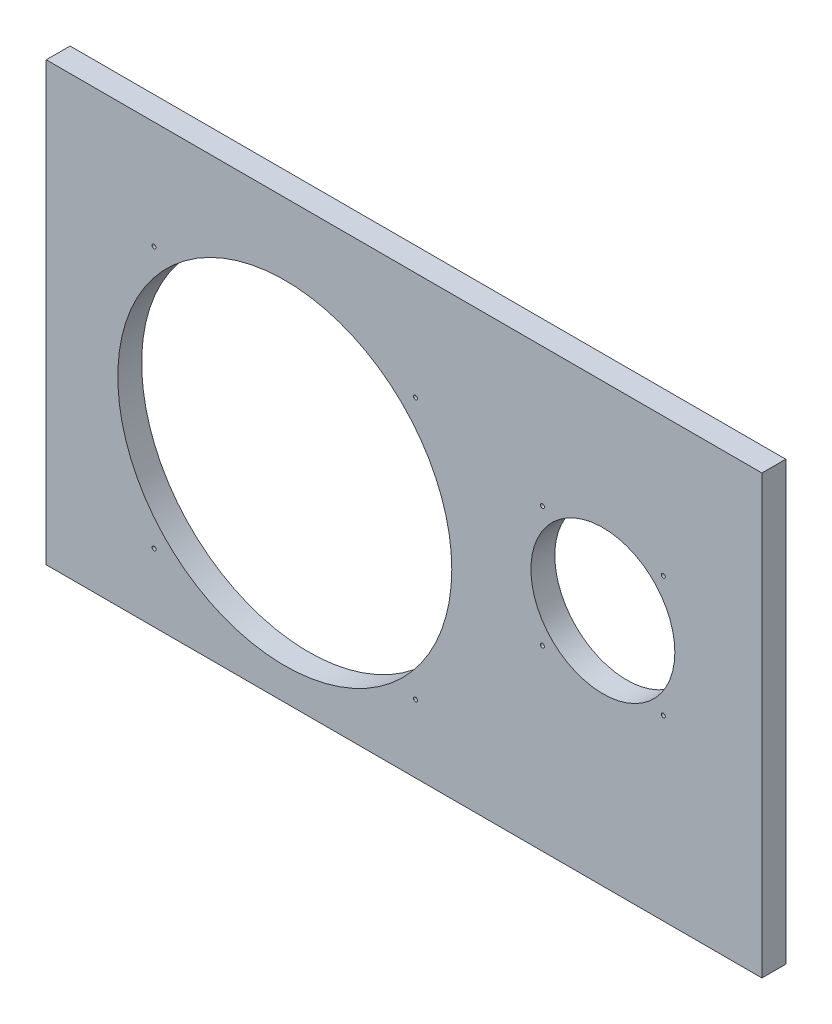
ISO-10303-21;
HEADER;
FILE_DESCRIPTION(('STEP AP214'),'2;1');
FILE_NAME('part.step','',(''),(''),'','','');
FILE_SCHEMA(('AUTOMOTIVE_DESIGN { 1 0 10303 214 1 1 1 1 }'));
ENDSEC;
DATA;
#1=APPLICATION_CONTEXT('core data for automotive mechanical design processes');
#2=APPLICATION_PROTOCOL_DEFINITION('international standard','automotive_design',2000,#1);
#3=PRODUCT_CONTEXT('',#1,'mechanical');
#4=PRODUCT('Part','Part','',(#3));
#5=PRODUCT_RELATED_PRODUCT_CATEGORY('part','',(#4));
#6=PRODUCT_DEFINITION_FORMATION('','',#4);
#7=PRODUCT_DEFINITION_CONTEXT('part definition',#1,'design');
#8=PRODUCT_DEFINITION('design','',#6,#7);
#9=PRODUCT_DEFINITION_SHAPE('','',#8);
#10=(LENGTH_UNIT() NAMED_UNIT(*) SI_UNIT(.MILLI.,.METRE.));
#11=(NAMED_UNIT(*) PLANE_ANGLE_UNIT() SI_UNIT($,.RADIAN.));
#12=(NAMED_UNIT(*) SI_UNIT($,.STERADIAN.) SOLID_ANGLE_UNIT());
#13=UNCERTAINTY_MEASURE_WITH_UNIT(LENGTH_MEASURE(1.E-05),#10,'distance_accuracy_value','');
#14=(GEOMETRIC_REPRESENTATION_CONTEXT(3) GLOBAL_UNCERTAINTY_ASSIGNED_CONTEXT((#13)) GLOBAL_UNIT_ASSIGNED_CONTEXT((#10,
#11,#12)) REPRESENTATION_CONTEXT('',''));
#15=CARTESIAN_POINT('',(0.,0.,0.));
#16=DIRECTION('',(0.,0.,1.));
#17=DIRECTION('',(1.,0.,0.));
#18=AXIS2_PLACEMENT_3D('',#15,#16,#17);
#19=CARTESIAN_POINT('',(0.,0.,6.));
#20=DIRECTION('',(0.,0.,-1.));
#21=DIRECTION('',(-1.,0.,0.));
#22=AXIS2_PLACEMENT_3D('',#19,#20,#21);
#23=PLANE('',#22);
#24=CARTESIAN_POINT('',(155.202795795511,44.7972042044892,6.));
#25=DIRECTION('',(0.,0.,-1.));
#26=DIRECTION('',(-1.,0.,0.));
#27=AXIS2_PLACEMENT_3D('',#24,#25,#26);
#28=CIRCLE('',#27,0.499999999999999);
#29=CARTESIAN_POINT('',(154.702795795511,44.7972042044892,6.));
#30=VERTEX_POINT('',#29);
#31=EDGE_CURVE('E164',#30,#30,#28,.F.);
#32=ORIENTED_EDGE('',*,*,#31,.F.);
#33=EDGE_LOOP('',(#32));
#34=FACE_BOUND('',#33,.T.);
#35=CARTESIAN_POINT('',(155.202795795511,75.2027957955108,6.));
#36=DIRECTION('',(0.,0.,-1.));
#37=DIRECTION('',(-1.,0.,0.));
#38=AXIS2_PLACEMENT_3D('',#35,#36,#37);
#39=CIRCLE('',#38,0.499999999999999);
#40=CARTESIAN_POINT('',(154.702795795511,75.2027957955108,6.));
#41=VERTEX_POINT('',#40);
#42=EDGE_CURVE('E158',#41,#41,#39,.F.);
#43=ORIENTED_EDGE('',*,*,#42,.F.);
#44=EDGE_LOOP('',(#43));
#45=FACE_BOUND('',#44,.T.);
#46=CARTESIAN_POINT('',(124.797204204489,75.2027957955107,6.));
#47=DIRECTION('',(0.,0.,-1.));
#48=DIRECTION('',(-1.,0.,0.));
#49=AXIS2_PLACEMENT_3D('',#46,#47,#48);
#50=CIRCLE('',#49,0.499999999999986);
#51=CARTESIAN_POINT('',(124.297204204489,75.2027957955107,6.));
#52=VERTEX_POINT('',#51);
#53=EDGE_CURVE('E152',#52,#52,#50,.F.);
#54=ORIENTED_EDGE('',*,*,#53,.F.);
#55=EDGE_LOOP('',(#54));
#56=FACE_BOUND('',#55,.T.);
#57=CARTESIAN_POINT('',(124.797204204489,44.7972042044892,6.));
#58=DIRECTION('',(0.,0.,-1.));
#59=DIRECTION('',(-1.,0.,0.));
#60=AXIS2_PLACEMENT_3D('',#57,#58,#59);
#61=CIRCLE('',#60,0.499999999999984);
#62=CARTESIAN_POINT('',(124.297204204489,44.7972042044892,6.));
#63=VERTEX_POINT('',#62);
#64=EDGE_CURVE('E146',#63,#63,#61,.F.);
#65=ORIENTED_EDGE('',*,*,#64,.F.);
#66=EDGE_LOOP('',(#65));
#67=FACE_BOUND('',#66,.T.);
#68=CARTESIAN_POINT('',(92.8804653251745,17.1195346748255,6.));
#69=DIRECTION('',(0.,0.,-1.));
#70=DIRECTION('',(-1.,0.,0.));
#71=AXIS2_PLACEMENT_3D('',#68,#69,#70);
#72=CIRCLE('',#71,0.499999999999999);
#73=CARTESIAN_POINT('',(92.3804653251745,17.1195346748255,6.));
#74=VERTEX_POINT('',#73);
#75=EDGE_CURVE('E140',#74,#74,#72,.F.);
#76=ORIENTED_EDGE('',*,*,#75,.F.);
#77=EDGE_LOOP('',(#76));
#78=FACE_BOUND('',#77,.T.);
#79=CARTESIAN_POINT('',(27.1195346748255,17.1195346748255,6.));
#80=DIRECTION('',(0.,0.,-1.));
#81=DIRECTION('',(-1.,0.,0.));
#82=AXIS2_PLACEMENT_3D('',#79,#80,#81);
#83=CIRCLE('',#82,0.499999999999999);
#84=CARTESIAN_POINT('',(26.6195346748255,17.1195346748255,6.));
#85=VERTEX_POINT('',#84);
#86=EDGE_CURVE('E134',#85,#85,#83,.F.);
#87=ORIENTED_EDGE('',*,*,#86,.F.);
#88=EDGE_LOOP('',(#87));
#89=FACE_BOUND('',#88,.T.);
#90=CARTESIAN_POINT('',(92.8804653251745,82.8804653251745,6.));
#91=DIRECTION('',(0.,0.,-1.));
#92=DIRECTION('',(-1.,0.,0.));
#93=AXIS2_PLACEMENT_3D('',#90,#91,#92);
#94=CIRCLE('',#93,0.499999999999999);
#95=CARTESIAN_POINT('',(92.3804653251745,82.8804653251745,6.));
#96=VERTEX_POINT('',#95);
#97=EDGE_CURVE('E128',#96,#96,#94,.F.);
#98=ORIENTED_EDGE('',*,*,#97,.F.);
#99=EDGE_LOOP('',(#98));
#100=FACE_BOUND('',#99,.T.);
#101=CARTESIAN_POINT('',(27.1195346748255,82.8804653251745,6.));
#102=DIRECTION('',(0.,0.,-1.));
#103=DIRECTION('',(-1.,0.,0.));
#104=AXIS2_PLACEMENT_3D('',#101,#102,#103);
#105=CIRCLE('',#104,0.499999999999999);
#106=CARTESIAN_POINT('',(26.6195346748255,82.8804653251745,6.));
#107=VERTEX_POINT('',#106);
#108=EDGE_CURVE('E120',#107,#107,#105,.F.);
#109=ORIENTED_EDGE('',*,*,#108,.F.);
#110=EDGE_LOOP('',(#109));
#111=FACE_BOUND('',#110,.T.);
#112=DIRECTION('',(0.,-1.,0.));
#113=VECTOR('',#112,1.);
#114=CARTESIAN_POINT('',(0.,0.,6.));
#115=LINE('',#114,#113);
#116=CARTESIAN_POINT('',(0.,110.,6.));
#117=VERTEX_POINT('',#116);
#118=CARTESIAN_POINT('',(0.,0.,6.));
#119=VERTEX_POINT('',#118);
#120=EDGE_CURVE('E84',#117,#119,#115,.T.);
#121=ORIENTED_EDGE('',*,*,#120,.T.);
#122=DIRECTION('',(1.,0.,0.));
#123=VECTOR('',#122,1.);
#124=CARTESIAN_POINT('',(0.,0.,6.));
#125=LINE('',#124,#123);
#126=CARTESIAN_POINT('',(180.,0.,6.));
#127=VERTEX_POINT('',#126);
#128=EDGE_CURVE('E79',#119,#127,#125,.T.);
#129=ORIENTED_EDGE('',*,*,#128,.T.);
#130=DIRECTION('',(0.,1.,0.));
#131=VECTOR('',#130,1.);
#132=CARTESIAN_POINT('',(180.,0.,6.));
#133=LINE('',#132,#131);
#134=CARTESIAN_POINT('',(180.,110.,6.));
#135=VERTEX_POINT('',#134);
#136=EDGE_CURVE('E82',#127,#135,#133,.T.);
#137=ORIENTED_EDGE('',*,*,#136,.T.);
#138=DIRECTION('',(-1.,0.,0.));
#139=VECTOR('',#138,1.);
#140=CARTESIAN_POINT('',(0.,110.,6.));
#141=LINE('',#140,#139);
#142=EDGE_CURVE('E49',#135,#117,#141,.T.);
#143=ORIENTED_EDGE('',*,*,#142,.T.);
#144=EDGE_LOOP('',(#121,#129,#137,#143));
#145=FACE_BOUND('',#144,.T.);
#146=CARTESIAN_POINT('',(60.,50.,6.));
#147=DIRECTION('',(0.,0.,1.));
#148=DIRECTION('',(1.,0.,0.));
#149=AXIS2_PLACEMENT_3D('',#146,#147,#148);
#150=CIRCLE('',#149,42.);
#151=CARTESIAN_POINT('',(102.,50.,6.));
#152=VERTEX_POINT('',#151);
#153=EDGE_CURVE('E99',#152,#152,#150,.T.);
#154=ORIENTED_EDGE('',*,*,#153,.F.);
#155=EDGE_LOOP('',(#154));
#156=FACE_BOUND('',#155,.T.);
#157=CARTESIAN_POINT('',(140.,60.,6.));
#158=DIRECTION('',(0.,0.,1.));
#159=DIRECTION('',(1.,0.,0.));
#160=AXIS2_PLACEMENT_3D('',#157,#158,#159);
#161=CIRCLE('',#160,18.1);
#162=CARTESIAN_POINT('',(158.1,60.,6.));
#163=VERTEX_POINT('',#162);
#164=EDGE_CURVE('E114',#163,#163,#161,.T.);
#165=ORIENTED_EDGE('',*,*,#164,.F.);
#166=EDGE_LOOP('',(#165));
#167=FACE_BOUND('',#166,.T.);
#168=ADVANCED_FACE('F32',(#34,#45,#56,#67,#78,#89,#100,#111,#145,#156,#167),#23,.F.);
#169=CARTESIAN_POINT('',(0.,0.,0.));
#170=DIRECTION('',(0.,0.,-1.));
#171=DIRECTION('',(-1.,0.,0.));
#172=AXIS2_PLACEMENT_3D('',#169,#170,#171);
#173=PLANE('',#172);
#174=CARTESIAN_POINT('',(155.202795795511,44.7972042044892,0.));
#175=DIRECTION('',(0.,0.,1.));
#176=DIRECTION('',(1.,0.,0.));
#177=AXIS2_PLACEMENT_3D('',#174,#175,#176);
#178=CIRCLE('',#177,0.499999999999999);
#179=CARTESIAN_POINT('',(155.702795795511,44.7972042044892,0.));
#180=VERTEX_POINT('',#179);
#181=EDGE_CURVE('E167',#180,#180,#178,.T.);
#182=ORIENTED_EDGE('',*,*,#181,.T.);
#183=EDGE_LOOP('',(#182));
#184=FACE_BOUND('',#183,.T.);
#185=CARTESIAN_POINT('',(155.202795795511,75.2027957955108,0.));
#186=DIRECTION('',(0.,0.,1.));
#187=DIRECTION('',(1.,0.,0.));
#188=AXIS2_PLACEMENT_3D('',#185,#186,#187);
#189=CIRCLE('',#188,0.499999999999999);
#190=CARTESIAN_POINT('',(155.702795795511,75.2027957955108,0.));
#191=VERTEX_POINT('',#190);
#192=EDGE_CURVE('E161',#191,#191,#189,.T.);
#193=ORIENTED_EDGE('',*,*,#192,.T.);
#194=EDGE_LOOP('',(#193));
#195=FACE_BOUND('',#194,.T.);
#196=CARTESIAN_POINT('',(124.797204204489,75.2027957955107,0.));
#197=DIRECTION('',(0.,0.,1.));
#198=DIRECTION('',(1.,0.,0.));
#199=AXIS2_PLACEMENT_3D('',#196,#197,#198);
#200=CIRCLE('',#199,0.499999999999986);
#201=CARTESIAN_POINT('',(125.297204204489,75.2027957955107,0.));
#202=VERTEX_POINT('',#201);
#203=EDGE_CURVE('E155',#202,#202,#200,.T.);
#204=ORIENTED_EDGE('',*,*,#203,.T.);
#205=EDGE_LOOP('',(#204));
#206=FACE_BOUND('',#205,.T.);
#207=CARTESIAN_POINT('',(124.797204204489,44.7972042044892,0.));
#208=DIRECTION('',(0.,0.,1.));
#209=DIRECTION('',(1.,0.,0.));
#210=AXIS2_PLACEMENT_3D('',#207,#208,#209);
#211=CIRCLE('',#210,0.499999999999984);
#212=CARTESIAN_POINT('',(125.297204204489,44.7972042044892,0.));
#213=VERTEX_POINT('',#212);
#214=EDGE_CURVE('E149',#213,#213,#211,.T.);
#215=ORIENTED_EDGE('',*,*,#214,.T.);
#216=EDGE_LOOP('',(#215));
#217=FACE_BOUND('',#216,.T.);
#218=CARTESIAN_POINT('',(92.8804653251745,17.1195346748255,0.));
#219=DIRECTION('',(0.,0.,1.));
#220=DIRECTION('',(1.,0.,0.));
#221=AXIS2_PLACEMENT_3D('',#218,#219,#220);
#222=CIRCLE('',#221,0.499999999999999);
#223=CARTESIAN_POINT('',(93.3804653251745,17.1195346748255,0.));
#224=VERTEX_POINT('',#223);
#225=EDGE_CURVE('E143',#224,#224,#222,.T.);
#226=ORIENTED_EDGE('',*,*,#225,.T.);
#227=EDGE_LOOP('',(#226));
#228=FACE_BOUND('',#227,.T.);
#229=CARTESIAN_POINT('',(27.1195346748255,17.1195346748255,0.));
#230=DIRECTION('',(0.,0.,1.));
#231=DIRECTION('',(1.,0.,0.));
#232=AXIS2_PLACEMENT_3D('',#229,#230,#231);
#233=CIRCLE('',#232,0.499999999999999);
#234=CARTESIAN_POINT('',(27.6195346748255,17.1195346748255,0.));
#235=VERTEX_POINT('',#234);
#236=EDGE_CURVE('E137',#235,#235,#233,.T.);
#237=ORIENTED_EDGE('',*,*,#236,.T.);
#238=EDGE_LOOP('',(#237));
#239=FACE_BOUND('',#238,.T.);
#240=CARTESIAN_POINT('',(92.8804653251745,82.8804653251745,0.));
#241=DIRECTION('',(0.,0.,1.));
#242=DIRECTION('',(1.,0.,0.));
#243=AXIS2_PLACEMENT_3D('',#240,#241,#242);
#244=CIRCLE('',#243,0.499999999999999);
#245=CARTESIAN_POINT('',(93.3804653251745,82.8804653251745,0.));
#246=VERTEX_POINT('',#245);
#247=EDGE_CURVE('E131',#246,#246,#244,.T.);
#248=ORIENTED_EDGE('',*,*,#247,.T.);
#249=EDGE_LOOP('',(#248));
#250=FACE_BOUND('',#249,.T.);
#251=CARTESIAN_POINT('',(27.1195346748255,82.8804653251745,0.));
#252=DIRECTION('',(0.,0.,1.));
#253=DIRECTION('',(1.,0.,0.));
#254=AXIS2_PLACEMENT_3D('',#251,#252,#253);
#255=CIRCLE('',#254,0.499999999999999);
#256=CARTESIAN_POINT('',(27.6195346748255,82.8804653251745,0.));
#257=VERTEX_POINT('',#256);
#258=EDGE_CURVE('E125',#257,#257,#255,.T.);
#259=ORIENTED_EDGE('',*,*,#258,.T.);
#260=EDGE_LOOP('',(#259));
#261=FACE_BOUND('',#260,.T.);
#262=CARTESIAN_POINT('',(60.,50.,0.));
#263=DIRECTION('',(0.,0.,1.));
#264=DIRECTION('',(1.,0.,0.));
#265=AXIS2_PLACEMENT_3D('',#262,#263,#264);
#266=CIRCLE('',#265,42.);
#267=CARTESIAN_POINT('',(102.,50.,0.));
#268=VERTEX_POINT('',#267);
#269=EDGE_CURVE('E111',#268,#268,#266,.T.);
#270=ORIENTED_EDGE('',*,*,#269,.T.);
#271=EDGE_LOOP('',(#270));
#272=FACE_BOUND('',#271,.T.);
#273=DIRECTION('',(0.,-1.,0.));
#274=VECTOR('',#273,1.);
#275=CARTESIAN_POINT('',(0.,0.,0.));
#276=LINE('',#275,#274);
#277=CARTESIAN_POINT('',(0.,110.,0.));
#278=VERTEX_POINT('',#277);
#279=CARTESIAN_POINT('',(0.,0.,0.));
#280=VERTEX_POINT('',#279);
#281=EDGE_CURVE('E96',#278,#280,#276,.T.);
#282=ORIENTED_EDGE('',*,*,#281,.F.);
#283=DIRECTION('',(-1.,0.,0.));
#284=VECTOR('',#283,1.);
#285=CARTESIAN_POINT('',(0.,110.,0.));
#286=LINE('',#285,#284);
#287=CARTESIAN_POINT('',(180.,110.,0.));
#288=VERTEX_POINT('',#287);
#289=EDGE_CURVE('E72',#288,#278,#286,.T.);
#290=ORIENTED_EDGE('',*,*,#289,.F.);
#291=DIRECTION('',(0.,1.,0.));
#292=VECTOR('',#291,1.);
#293=CARTESIAN_POINT('',(180.,0.,0.));
#294=LINE('',#293,#292);
#295=CARTESIAN_POINT('',(180.,0.,0.));
#296=VERTEX_POINT('',#295);
#297=EDGE_CURVE('E66',#296,#288,#294,.T.);
#298=ORIENTED_EDGE('',*,*,#297,.F.);
#299=DIRECTION('',(1.,0.,0.));
#300=VECTOR('',#299,1.);
#301=CARTESIAN_POINT('',(0.,0.,0.));
#302=LINE('',#301,#300);
#303=EDGE_CURVE('E88',#280,#296,#302,.T.);
#304=ORIENTED_EDGE('',*,*,#303,.F.);
#305=EDGE_LOOP('',(#282,#290,#298,#304));
#306=FACE_BOUND('',#305,.T.);
#307=CARTESIAN_POINT('',(140.,60.,0.));
#308=DIRECTION('',(0.,0.,1.));
#309=DIRECTION('',(1.,0.,0.));
#310=AXIS2_PLACEMENT_3D('',#307,#308,#309);
#311=CIRCLE('',#310,18.1);
#312=CARTESIAN_POINT('',(158.1,60.,0.));
#313=VERTEX_POINT('',#312);
#314=EDGE_CURVE('E117',#313,#313,#311,.T.);
#315=ORIENTED_EDGE('',*,*,#314,.T.);
#316=EDGE_LOOP('',(#315));
#317=FACE_BOUND('',#316,.T.);
#318=ADVANCED_FACE('F107',(#184,#195,#206,#217,#228,#239,#250,#261,#272,#306,#317),#173,.T.);
#319=CARTESIAN_POINT('',(0.,0.,6.));
#320=DIRECTION('',(1.,0.,0.));
#321=DIRECTION('',(0.,0.,-1.));
#322=AXIS2_PLACEMENT_3D('',#319,#320,#321);
#323=PLANE('',#322);
#324=ORIENTED_EDGE('',*,*,#281,.T.);
#325=DIRECTION('',(0.,0.,-1.));
#326=VECTOR('',#325,1.);
#327=CARTESIAN_POINT('',(0.,0.,6.));
#328=LINE('',#327,#326);
#329=EDGE_CURVE('E11',#119,#280,#328,.T.);
#330=ORIENTED_EDGE('',*,*,#329,.F.);
#331=ORIENTED_EDGE('',*,*,#120,.F.);
#332=DIRECTION('',(0.,0.,-1.));
#333=VECTOR('',#332,1.);
#334=CARTESIAN_POINT('',(0.,110.,6.));
#335=LINE('',#334,#333);
#336=EDGE_CURVE('E92',#117,#278,#335,.T.);
#337=ORIENTED_EDGE('',*,*,#336,.T.);
#338=EDGE_LOOP('',(#324,#330,#331,#337));
#339=FACE_BOUND('',#338,.T.);
#340=ADVANCED_FACE('F34',(#339),#323,.F.);
#341=CARTESIAN_POINT('',(0.,0.,6.));
#342=DIRECTION('',(0.,1.,0.));
#343=DIRECTION('',(0.,0.,1.));
#344=AXIS2_PLACEMENT_3D('',#341,#342,#343);
#345=PLANE('',#344);
#346=ORIENTED_EDGE('',*,*,#303,.T.);
#347=DIRECTION('',(0.,0.,-1.));
#348=VECTOR('',#347,1.);
#349=CARTESIAN_POINT('',(180.,0.,6.));
#350=LINE('',#349,#348);
#351=EDGE_CURVE('E41',#127,#296,#350,.T.);
#352=ORIENTED_EDGE('',*,*,#351,.F.);
#353=ORIENTED_EDGE('',*,*,#128,.F.);
#354=ORIENTED_EDGE('',*,*,#329,.T.);
#355=EDGE_LOOP('',(#346,#352,#353,#354));
#356=FACE_BOUND('',#355,.T.);
#357=ADVANCED_FACE('F87',(#356),#345,.F.);
#358=CARTESIAN_POINT('',(180.,0.,6.));
#359=DIRECTION('',(-1.,0.,0.));
#360=DIRECTION('',(0.,0.,1.));
#361=AXIS2_PLACEMENT_3D('',#358,#359,#360);
#362=PLANE('',#361);
#363=ORIENTED_EDGE('',*,*,#297,.T.);
#364=DIRECTION('',(0.,0.,-1.));
#365=VECTOR('',#364,1.);
#366=CARTESIAN_POINT('',(180.,110.,6.));
#367=LINE('',#366,#365);
#368=EDGE_CURVE('E89',#135,#288,#367,.T.);
#369=ORIENTED_EDGE('',*,*,#368,.F.);
#370=ORIENTED_EDGE('',*,*,#136,.F.);
#371=ORIENTED_EDGE('',*,*,#351,.T.);
#372=EDGE_LOOP('',(#363,#369,#370,#371));
#373=FACE_BOUND('',#372,.T.);
#374=ADVANCED_FACE('F90',(#373),#362,.F.);
#375=CARTESIAN_POINT('',(0.,110.,6.));
#376=DIRECTION('',(0.,-1.,0.));
#377=DIRECTION('',(0.,0.,-1.));
#378=AXIS2_PLACEMENT_3D('',#375,#376,#377);
#379=PLANE('',#378);
#380=ORIENTED_EDGE('',*,*,#289,.T.);
#381=ORIENTED_EDGE('',*,*,#336,.F.);
#382=ORIENTED_EDGE('',*,*,#142,.F.);
#383=ORIENTED_EDGE('',*,*,#368,.T.);
#384=EDGE_LOOP('',(#380,#381,#382,#383));
#385=FACE_BOUND('',#384,.T.);
#386=ADVANCED_FACE('F104',(#385),#379,.F.);
#387=CARTESIAN_POINT('',(60.,50.,6.));
#388=DIRECTION('',(0.,0.,-1.));
#389=DIRECTION('',(-1.,0.,0.));
#390=AXIS2_PLACEMENT_3D('',#387,#388,#389);
#391=CYLINDRICAL_SURFACE('',#390,42.);
#392=ORIENTED_EDGE('',*,*,#153,.T.);
#393=EDGE_LOOP('',(#392));
#394=FACE_BOUND('',#393,.T.);
#395=ORIENTED_EDGE('',*,*,#269,.F.);
#396=EDGE_LOOP('',(#395));
#397=FACE_BOUND('',#396,.T.);
#398=ADVANCED_FACE('F210',(#394,#397),#391,.F.);
#399=CARTESIAN_POINT('',(140.,60.,6.));
#400=DIRECTION('',(0.,0.,-1.));
#401=DIRECTION('',(-1.,0.,0.));
#402=AXIS2_PLACEMENT_3D('',#399,#400,#401);
#403=CYLINDRICAL_SURFACE('',#402,18.1);
#404=ORIENTED_EDGE('',*,*,#164,.T.);
#405=EDGE_LOOP('',(#404));
#406=FACE_BOUND('',#405,.T.);
#407=ORIENTED_EDGE('',*,*,#314,.F.);
#408=EDGE_LOOP('',(#407));
#409=FACE_BOUND('',#408,.T.);
#410=ADVANCED_FACE('F200',(#406,#409),#403,.F.);
#411=CARTESIAN_POINT('',(27.1195346748255,82.8804653251745,30.));
#412=DIRECTION('',(0.,0.,-1.));
#413=DIRECTION('',(-1.,0.,0.));
#414=AXIS2_PLACEMENT_3D('',#411,#412,#413);
#415=CYLINDRICAL_SURFACE('',#414,0.499999999999999);
#416=ORIENTED_EDGE('',*,*,#258,.F.);
#417=EDGE_LOOP('',(#416));
#418=FACE_BOUND('',#417,.T.);
#419=ORIENTED_EDGE('',*,*,#108,.T.);
#420=EDGE_LOOP('',(#419));
#421=FACE_BOUND('',#420,.T.);
#422=ADVANCED_FACE('F197',(#418,#421),#415,.F.);
#423=CARTESIAN_POINT('',(92.8804653251745,82.8804653251745,30.));
#424=DIRECTION('',(0.,0.,-1.));
#425=DIRECTION('',(-1.,0.,0.));
#426=AXIS2_PLACEMENT_3D('',#423,#424,#425);
#427=CYLINDRICAL_SURFACE('',#426,0.499999999999999);
#428=ORIENTED_EDGE('',*,*,#247,.F.);
#429=EDGE_LOOP('',(#428));
#430=FACE_BOUND('',#429,.T.);
#431=ORIENTED_EDGE('',*,*,#97,.T.);
#432=EDGE_LOOP('',(#431));
#433=FACE_BOUND('',#432,.T.);
#434=ADVANCED_FACE('F199',(#430,#433),#427,.F.);
#435=CARTESIAN_POINT('',(27.1195346748255,17.1195346748255,30.));
#436=DIRECTION('',(0.,0.,-1.));
#437=DIRECTION('',(-1.,0.,0.));
#438=AXIS2_PLACEMENT_3D('',#435,#436,#437);
#439=CYLINDRICAL_SURFACE('',#438,0.499999999999999);
#440=ORIENTED_EDGE('',*,*,#236,.F.);
#441=EDGE_LOOP('',(#440));
#442=FACE_BOUND('',#441,.T.);
#443=ORIENTED_EDGE('',*,*,#86,.T.);
#444=EDGE_LOOP('',(#443));
#445=FACE_BOUND('',#444,.T.);
#446=ADVANCED_FACE('F207',(#442,#445),#439,.F.);
#447=CARTESIAN_POINT('',(92.8804653251745,17.1195346748255,30.));
#448=DIRECTION('',(0.,0.,-1.));
#449=DIRECTION('',(-1.,0.,0.));
#450=AXIS2_PLACEMENT_3D('',#447,#448,#449);
#451=CYLINDRICAL_SURFACE('',#450,0.499999999999999);
#452=ORIENTED_EDGE('',*,*,#225,.F.);
#453=EDGE_LOOP('',(#452));
#454=FACE_BOUND('',#453,.T.);
#455=ORIENTED_EDGE('',*,*,#75,.T.);
#456=EDGE_LOOP('',(#455));
#457=FACE_BOUND('',#456,.T.);
#458=ADVANCED_FACE('F289',(#454,#457),#451,.F.);
#459=CARTESIAN_POINT('',(124.797204204489,44.7972042044892,30.));
#460=DIRECTION('',(0.,0.,-1.));
#461=DIRECTION('',(-1.,0.,0.));
#462=AXIS2_PLACEMENT_3D('',#459,#460,#461);
#463=CYLINDRICAL_SURFACE('',#462,0.499999999999984);
#464=ORIENTED_EDGE('',*,*,#214,.F.);
#465=EDGE_LOOP('',(#464));
#466=FACE_BOUND('',#465,.T.);
#467=ORIENTED_EDGE('',*,*,#64,.T.);
#468=EDGE_LOOP('',(#467));
#469=FACE_BOUND('',#468,.T.);
#470=ADVANCED_FACE('F297',(#466,#469),#463,.F.);
#471=CARTESIAN_POINT('',(124.797204204489,75.2027957955107,30.));
#472=DIRECTION('',(0.,0.,-1.));
#473=DIRECTION('',(-1.,0.,0.));
#474=AXIS2_PLACEMENT_3D('',#471,#472,#473);
#475=CYLINDRICAL_SURFACE('',#474,0.499999999999986);
#476=ORIENTED_EDGE('',*,*,#203,.F.);
#477=EDGE_LOOP('',(#476));
#478=FACE_BOUND('',#477,.T.);
#479=ORIENTED_EDGE('',*,*,#53,.T.);
#480=EDGE_LOOP('',(#479));
#481=FACE_BOUND('',#480,.T.);
#482=ADVANCED_FACE('F306',(#478,#481),#475,.F.);
#483=CARTESIAN_POINT('',(155.202795795511,75.2027957955108,30.));
#484=DIRECTION('',(0.,0.,-1.));
#485=DIRECTION('',(-1.,0.,0.));
#486=AXIS2_PLACEMENT_3D('',#483,#484,#485);
#487=CYLINDRICAL_SURFACE('',#486,0.499999999999999);
#488=ORIENTED_EDGE('',*,*,#192,.F.);
#489=EDGE_LOOP('',(#488));
#490=FACE_BOUND('',#489,.T.);
#491=ORIENTED_EDGE('',*,*,#42,.T.);
#492=EDGE_LOOP('',(#491));
#493=FACE_BOUND('',#492,.T.);
#494=ADVANCED_FACE('F176',(#490,#493),#487,.F.);
#495=CARTESIAN_POINT('',(155.202795795511,44.7972042044892,30.));
#496=DIRECTION('',(0.,0.,-1.));
#497=DIRECTION('',(-1.,0.,0.));
#498=AXIS2_PLACEMENT_3D('',#495,#496,#497);
#499=CYLINDRICAL_SURFACE('',#498,0.499999999999999);
#500=ORIENTED_EDGE('',*,*,#181,.F.);
#501=EDGE_LOOP('',(#500));
#502=FACE_BOUND('',#501,.T.);
#503=ORIENTED_EDGE('',*,*,#31,.T.);
#504=EDGE_LOOP('',(#503));
#505=FACE_BOUND('',#504,.T.);
#506=ADVANCED_FACE('F173',(#502,#505),#499,.F.);
#507=CLOSED_SHELL('',(#168,#318,#340,#357,#374,#386,#398,#410,#422,#434,#446,#458,#470,#482,
#494,#506));
#508=MANIFOLD_SOLID_BREP('B2',#507);
#509=ADVANCED_BREP_SHAPE_REPRESENTATION('',(#18,#508),#14);
#510=SHAPE_DEFINITION_REPRESENTATION(#9,#509);
ENDSEC;
END-ISO-10303-21;
